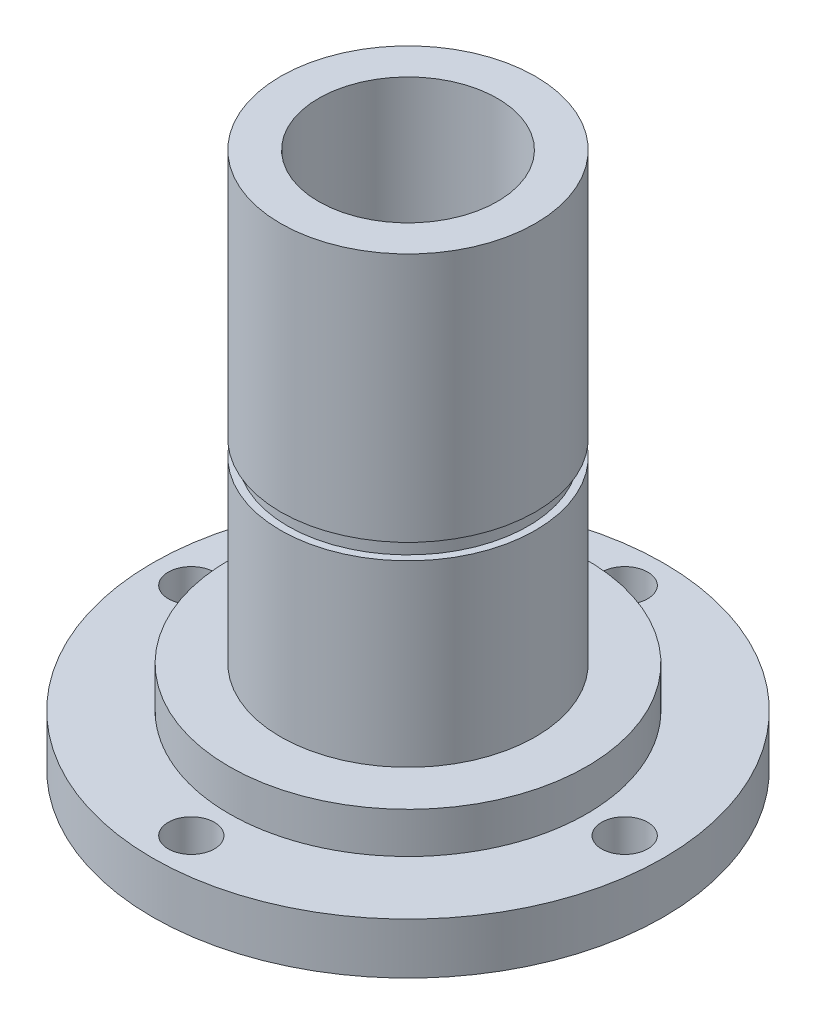
ISO-10303-21;
HEADER;
FILE_DESCRIPTION(('STEP AP214'),'2;1');
FILE_NAME('part.step','',(''),(''),'','','');
FILE_SCHEMA(('AUTOMOTIVE_DESIGN { 1 0 10303 214 1 1 1 1 }'));
ENDSEC;
DATA;
#1=APPLICATION_CONTEXT('core data for automotive mechanical design processes');
#2=APPLICATION_PROTOCOL_DEFINITION('international standard','automotive_design',2000,#1);
#3=PRODUCT_CONTEXT('',#1,'mechanical');
#4=PRODUCT('Part','Part','',(#3));
#5=PRODUCT_RELATED_PRODUCT_CATEGORY('part','',(#4));
#6=PRODUCT_DEFINITION_FORMATION('','',#4);
#7=PRODUCT_DEFINITION_CONTEXT('part definition',#1,'design');
#8=PRODUCT_DEFINITION('design','',#6,#7);
#9=PRODUCT_DEFINITION_SHAPE('','',#8);
#10=(LENGTH_UNIT() NAMED_UNIT(*) SI_UNIT(.MILLI.,.METRE.));
#11=(NAMED_UNIT(*) PLANE_ANGLE_UNIT() SI_UNIT($,.RADIAN.));
#12=(NAMED_UNIT(*) SI_UNIT($,.STERADIAN.) SOLID_ANGLE_UNIT());
#13=UNCERTAINTY_MEASURE_WITH_UNIT(LENGTH_MEASURE(1.E-05),#10,'distance_accuracy_value','');
#14=(GEOMETRIC_REPRESENTATION_CONTEXT(3) GLOBAL_UNCERTAINTY_ASSIGNED_CONTEXT((#13)) GLOBAL_UNIT_ASSIGNED_CONTEXT((#10,
#11,#12)) REPRESENTATION_CONTEXT('',''));
#15=CARTESIAN_POINT('',(0.,0.,0.));
#16=DIRECTION('',(0.,0.,1.));
#17=DIRECTION('',(1.,0.,0.));
#18=AXIS2_PLACEMENT_3D('',#15,#16,#17);
#19=CARTESIAN_POINT('',(0.,3.175,0.));
#20=DIRECTION('',(0.,-1.,0.));
#21=DIRECTION('',(0.,0.,-1.));
#22=AXIS2_PLACEMENT_3D('',#19,#20,#21);
#23=CYLINDRICAL_SURFACE('',#22,15.875);
#24=CARTESIAN_POINT('',(0.,3.175,0.));
#25=DIRECTION('',(0.,-1.,0.));
#26=DIRECTION('',(0.,0.,-1.));
#27=AXIS2_PLACEMENT_3D('',#24,#25,#26);
#28=CIRCLE('',#27,15.875);
#29=CARTESIAN_POINT('',(0.,3.175,-15.875));
#30=VERTEX_POINT('',#29);
#31=EDGE_CURVE('E12',#30,#30,#28,.T.);
#32=ORIENTED_EDGE('',*,*,#31,.T.);
#33=EDGE_LOOP('',(#32));
#34=FACE_BOUND('',#33,.T.);
#35=CARTESIAN_POINT('',(0.,0.,0.));
#36=DIRECTION('',(0.,-1.,0.));
#37=DIRECTION('',(0.,0.,-1.));
#38=AXIS2_PLACEMENT_3D('',#35,#36,#37);
#39=CIRCLE('',#38,15.875);
#40=CARTESIAN_POINT('',(0.,0.,-15.875));
#41=VERTEX_POINT('',#40);
#42=EDGE_CURVE('E46',#41,#41,#39,.T.);
#43=ORIENTED_EDGE('',*,*,#42,.F.);
#44=EDGE_LOOP('',(#43));
#45=FACE_BOUND('',#44,.T.);
#46=ADVANCED_FACE('F43',(#34,#45),#23,.T.);
#47=CARTESIAN_POINT('',(0.,3.175,0.));
#48=DIRECTION('',(0.,-1.,0.));
#49=DIRECTION('',(0.,0.,-1.));
#50=AXIS2_PLACEMENT_3D('',#47,#48,#49);
#51=PLANE('',#50);
#52=CARTESIAN_POINT('',(-13.462,3.175,0.));
#53=DIRECTION('',(0.,-1.,0.));
#54=DIRECTION('',(0.,0.,-1.));
#55=AXIS2_PLACEMENT_3D('',#52,#53,#54);
#56=CIRCLE('',#55,1.4351);
#57=CARTESIAN_POINT('',(-13.462,3.175,-1.4351));
#58=VERTEX_POINT('',#57);
#59=EDGE_CURVE('E76',#58,#58,#56,.T.);
#60=ORIENTED_EDGE('',*,*,#59,.T.);
#61=EDGE_LOOP('',(#60));
#62=FACE_BOUND('',#61,.T.);
#63=CARTESIAN_POINT('',(0.,3.175,-13.462));
#64=DIRECTION('',(0.,-1.,0.));
#65=DIRECTION('',(0.,0.,-1.));
#66=AXIS2_PLACEMENT_3D('',#63,#64,#65);
#67=CIRCLE('',#66,1.4351);
#68=CARTESIAN_POINT('',(0.,3.175,-14.8971));
#69=VERTEX_POINT('',#68);
#70=EDGE_CURVE('E70',#69,#69,#67,.T.);
#71=ORIENTED_EDGE('',*,*,#70,.T.);
#72=EDGE_LOOP('',(#71));
#73=FACE_BOUND('',#72,.T.);
#74=CARTESIAN_POINT('',(13.462,3.175,0.));
#75=DIRECTION('',(0.,-1.,0.));
#76=DIRECTION('',(0.,0.,-1.));
#77=AXIS2_PLACEMENT_3D('',#74,#75,#76);
#78=CIRCLE('',#77,1.4351);
#79=CARTESIAN_POINT('',(13.462,3.175,-1.4351));
#80=VERTEX_POINT('',#79);
#81=EDGE_CURVE('E64',#80,#80,#78,.T.);
#82=ORIENTED_EDGE('',*,*,#81,.T.);
#83=EDGE_LOOP('',(#82));
#84=FACE_BOUND('',#83,.T.);
#85=CARTESIAN_POINT('',(0.,3.175,0.));
#86=DIRECTION('',(0.,-1.,0.));
#87=DIRECTION('',(0.,0.,-1.));
#88=AXIS2_PLACEMENT_3D('',#85,#86,#87);
#89=CIRCLE('',#88,11.1125);
#90=CARTESIAN_POINT('',(0.,3.175,-11.1125));
#91=VERTEX_POINT('',#90);
#92=EDGE_CURVE('E58',#91,#91,#89,.T.);
#93=ORIENTED_EDGE('',*,*,#92,.T.);
#94=EDGE_LOOP('',(#93));
#95=FACE_BOUND('',#94,.T.);
#96=CARTESIAN_POINT('',(0.,3.175,13.462));
#97=DIRECTION('',(0.,-1.,0.));
#98=DIRECTION('',(0.,0.,-1.));
#99=AXIS2_PLACEMENT_3D('',#96,#97,#98);
#100=CIRCLE('',#99,1.4351);
#101=CARTESIAN_POINT('',(0.,3.175,12.0269));
#102=VERTEX_POINT('',#101);
#103=EDGE_CURVE('E53',#102,#102,#100,.T.);
#104=ORIENTED_EDGE('',*,*,#103,.T.);
#105=EDGE_LOOP('',(#104));
#106=FACE_BOUND('',#105,.T.);
#107=ORIENTED_EDGE('',*,*,#31,.F.);
#108=EDGE_LOOP('',(#107));
#109=FACE_BOUND('',#108,.T.);
#110=ADVANCED_FACE('F85',(#62,#73,#84,#95,#106,#109),#51,.F.);
#111=CARTESIAN_POINT('',(0.,0.,0.));
#112=DIRECTION('',(0.,-1.,0.));
#113=DIRECTION('',(0.,0.,-1.));
#114=AXIS2_PLACEMENT_3D('',#111,#112,#113);
#115=PLANE('',#114);
#116=CARTESIAN_POINT('',(-13.462,0.,0.));
#117=DIRECTION('',(0.,-1.,0.));
#118=DIRECTION('',(0.,0.,-1.));
#119=AXIS2_PLACEMENT_3D('',#116,#117,#118);
#120=CIRCLE('',#119,1.4351);
#121=CARTESIAN_POINT('',(-13.462,0.,-1.4351));
#122=VERTEX_POINT('',#121);
#123=EDGE_CURVE('E79',#122,#122,#120,.T.);
#124=ORIENTED_EDGE('',*,*,#123,.F.);
#125=EDGE_LOOP('',(#124));
#126=FACE_BOUND('',#125,.T.);
#127=CARTESIAN_POINT('',(0.,0.,-13.462));
#128=DIRECTION('',(0.,-1.,0.));
#129=DIRECTION('',(0.,0.,-1.));
#130=AXIS2_PLACEMENT_3D('',#127,#128,#129);
#131=CIRCLE('',#130,1.4351);
#132=CARTESIAN_POINT('',(0.,0.,-14.8971));
#133=VERTEX_POINT('',#132);
#134=EDGE_CURVE('E73',#133,#133,#131,.T.);
#135=ORIENTED_EDGE('',*,*,#134,.F.);
#136=EDGE_LOOP('',(#135));
#137=FACE_BOUND('',#136,.T.);
#138=CARTESIAN_POINT('',(13.462,0.,0.));
#139=DIRECTION('',(0.,-1.,0.));
#140=DIRECTION('',(0.,0.,-1.));
#141=AXIS2_PLACEMENT_3D('',#138,#139,#140);
#142=CIRCLE('',#141,1.4351);
#143=CARTESIAN_POINT('',(13.462,0.,-1.4351));
#144=VERTEX_POINT('',#143);
#145=EDGE_CURVE('E67',#144,#144,#142,.T.);
#146=ORIENTED_EDGE('',*,*,#145,.F.);
#147=EDGE_LOOP('',(#146));
#148=FACE_BOUND('',#147,.T.);
#149=CARTESIAN_POINT('',(0.,0.,0.));
#150=DIRECTION('',(0.,-1.,0.));
#151=DIRECTION('',(0.,0.,-1.));
#152=AXIS2_PLACEMENT_3D('',#149,#150,#151);
#153=CIRCLE('',#152,11.1125);
#154=CARTESIAN_POINT('',(0.,0.,-11.1125));
#155=VERTEX_POINT('',#154);
#156=EDGE_CURVE('E61',#155,#155,#153,.T.);
#157=ORIENTED_EDGE('',*,*,#156,.F.);
#158=EDGE_LOOP('',(#157));
#159=FACE_BOUND('',#158,.T.);
#160=CARTESIAN_POINT('',(0.,0.,13.462));
#161=DIRECTION('',(0.,-1.,0.));
#162=DIRECTION('',(0.,0.,-1.));
#163=AXIS2_PLACEMENT_3D('',#160,#161,#162);
#164=CIRCLE('',#163,1.4351);
#165=CARTESIAN_POINT('',(0.,0.,12.0269));
#166=VERTEX_POINT('',#165);
#167=EDGE_CURVE('E55',#166,#166,#164,.T.);
#168=ORIENTED_EDGE('',*,*,#167,.F.);
#169=EDGE_LOOP('',(#168));
#170=FACE_BOUND('',#169,.T.);
#171=ORIENTED_EDGE('',*,*,#42,.T.);
#172=EDGE_LOOP('',(#171));
#173=FACE_BOUND('',#172,.T.);
#174=ADVANCED_FACE('F95',(#126,#137,#148,#159,#170,#173),#115,.T.);
#175=CARTESIAN_POINT('',(0.,3.175,13.462));
#176=DIRECTION('',(0.,-1.,0.));
#177=DIRECTION('',(0.,0.,-1.));
#178=AXIS2_PLACEMENT_3D('',#175,#176,#177);
#179=CYLINDRICAL_SURFACE('',#178,1.4351);
#180=ORIENTED_EDGE('',*,*,#103,.F.);
#181=EDGE_LOOP('',(#180));
#182=FACE_BOUND('',#181,.T.);
#183=ORIENTED_EDGE('',*,*,#167,.T.);
#184=EDGE_LOOP('',(#183));
#185=FACE_BOUND('',#184,.T.);
#186=ADVANCED_FACE('F98',(#182,#185),#179,.F.);
#187=CARTESIAN_POINT('',(0.,3.175,0.));
#188=DIRECTION('',(0.,-1.,0.));
#189=DIRECTION('',(0.,0.,-1.));
#190=AXIS2_PLACEMENT_3D('',#187,#188,#189);
#191=CYLINDRICAL_SURFACE('',#190,11.1125);
#192=ORIENTED_EDGE('',*,*,#92,.F.);
#193=EDGE_LOOP('',(#192));
#194=FACE_BOUND('',#193,.T.);
#195=ORIENTED_EDGE('',*,*,#156,.T.);
#196=EDGE_LOOP('',(#195));
#197=FACE_BOUND('',#196,.T.);
#198=ADVANCED_FACE('F119',(#194,#197),#191,.F.);
#199=CARTESIAN_POINT('',(13.462,3.175,0.));
#200=DIRECTION('',(0.,-1.,0.));
#201=DIRECTION('',(0.,0.,-1.));
#202=AXIS2_PLACEMENT_3D('',#199,#200,#201);
#203=CYLINDRICAL_SURFACE('',#202,1.4351);
#204=ORIENTED_EDGE('',*,*,#81,.F.);
#205=EDGE_LOOP('',(#204));
#206=FACE_BOUND('',#205,.T.);
#207=ORIENTED_EDGE('',*,*,#145,.T.);
#208=EDGE_LOOP('',(#207));
#209=FACE_BOUND('',#208,.T.);
#210=ADVANCED_FACE('F123',(#206,#209),#203,.F.);
#211=CARTESIAN_POINT('',(0.,3.175,-13.462));
#212=DIRECTION('',(0.,-1.,0.));
#213=DIRECTION('',(0.,0.,-1.));
#214=AXIS2_PLACEMENT_3D('',#211,#212,#213);
#215=CYLINDRICAL_SURFACE('',#214,1.4351);
#216=ORIENTED_EDGE('',*,*,#70,.F.);
#217=EDGE_LOOP('',(#216));
#218=FACE_BOUND('',#217,.T.);
#219=ORIENTED_EDGE('',*,*,#134,.T.);
#220=EDGE_LOOP('',(#219));
#221=FACE_BOUND('',#220,.T.);
#222=ADVANCED_FACE('F91',(#218,#221),#215,.F.);
#223=CARTESIAN_POINT('',(-13.462,3.175,0.));
#224=DIRECTION('',(0.,-1.,0.));
#225=DIRECTION('',(0.,0.,-1.));
#226=AXIS2_PLACEMENT_3D('',#223,#224,#225);
#227=CYLINDRICAL_SURFACE('',#226,1.4351);
#228=ORIENTED_EDGE('',*,*,#59,.F.);
#229=EDGE_LOOP('',(#228));
#230=FACE_BOUND('',#229,.T.);
#231=ORIENTED_EDGE('',*,*,#123,.T.);
#232=EDGE_LOOP('',(#231));
#233=FACE_BOUND('',#232,.T.);
#234=ADVANCED_FACE('F88',(#230,#233),#227,.F.);
#235=CLOSED_SHELL('',(#46,#110,#174,#186,#198,#210,#222,#234));
#236=MANIFOLD_SOLID_BREP('B2',#235);
#237=CARTESIAN_POINT('',(0.,33.3375,0.));
#238=DIRECTION('',(0.,-1.,0.));
#239=DIRECTION('',(0.,0.,-1.));
#240=AXIS2_PLACEMENT_3D('',#237,#238,#239);
#241=CYLINDRICAL_SURFACE('',#240,7.91845);
#242=CARTESIAN_POINT('',(0.,5.715,0.));
#243=DIRECTION('',(0.,1.,0.));
#244=DIRECTION('',(0.,0.,1.));
#245=AXIS2_PLACEMENT_3D('',#242,#243,#244);
#246=CIRCLE('',#245,7.91845);
#247=CARTESIAN_POINT('',(0.,5.715,7.91845));
#248=VERTEX_POINT('',#247);
#249=EDGE_CURVE('E230',#248,#248,#246,.T.);
#250=ORIENTED_EDGE('',*,*,#249,.T.);
#251=EDGE_LOOP('',(#250));
#252=FACE_BOUND('',#251,.T.);
#253=CARTESIAN_POINT('',(0.,16.8275,0.));
#254=DIRECTION('',(0.,1.,0.));
#255=DIRECTION('',(0.,0.,1.));
#256=AXIS2_PLACEMENT_3D('',#253,#254,#255);
#257=CIRCLE('',#256,7.91845);
#258=CARTESIAN_POINT('',(0.,16.8275,7.91845));
#259=VERTEX_POINT('',#258);
#260=EDGE_CURVE('E213',#259,#259,#257,.T.);
#261=ORIENTED_EDGE('',*,*,#260,.F.);
#262=EDGE_LOOP('',(#261));
#263=FACE_BOUND('',#262,.T.);
#264=ADVANCED_FACE('F196',(#252,#263),#241,.T.);
#265=CARTESIAN_POINT('',(0.,5.715,0.));
#266=DIRECTION('',(0.,1.,0.));
#267=DIRECTION('',(0.,0.,1.));
#268=AXIS2_PLACEMENT_3D('',#265,#266,#267);
#269=PLANE('',#268);
#270=CARTESIAN_POINT('',(0.,5.715,0.));
#271=DIRECTION('',(0.,1.,0.));
#272=DIRECTION('',(0.,0.,1.));
#273=AXIS2_PLACEMENT_3D('',#270,#271,#272);
#274=CIRCLE('',#273,11.1125);
#275=CARTESIAN_POINT('',(0.,5.715,11.1125));
#276=VERTEX_POINT('',#275);
#277=EDGE_CURVE('E42',#276,#276,#274,.T.);
#278=ORIENTED_EDGE('',*,*,#277,.T.);
#279=EDGE_LOOP('',(#278));
#280=FACE_BOUND('',#279,.T.);
#281=ORIENTED_EDGE('',*,*,#249,.F.);
#282=EDGE_LOOP('',(#281));
#283=FACE_BOUND('',#282,.T.);
#284=ADVANCED_FACE('F238',(#280,#283),#269,.T.);
#285=CARTESIAN_POINT('',(0.,0.,0.));
#286=DIRECTION('',(0.,1.,0.));
#287=DIRECTION('',(0.,0.,1.));
#288=AXIS2_PLACEMENT_3D('',#285,#286,#287);
#289=PLANE('',#288);
#290=CARTESIAN_POINT('',(0.,0.,0.));
#291=DIRECTION('',(0.,1.,0.));
#292=DIRECTION('',(0.,0.,1.));
#293=AXIS2_PLACEMENT_3D('',#290,#291,#292);
#294=CIRCLE('',#293,11.1125);
#295=CARTESIAN_POINT('',(0.,0.,11.1125));
#296=VERTEX_POINT('',#295);
#297=EDGE_CURVE('E204',#296,#296,#294,.T.);
#298=ORIENTED_EDGE('',*,*,#297,.F.);
#299=EDGE_LOOP('',(#298));
#300=FACE_BOUND('',#299,.T.);
#301=CARTESIAN_POINT('',(0.,0.,0.));
#302=DIRECTION('',(0.,1.,0.));
#303=DIRECTION('',(0.,0.,1.));
#304=AXIS2_PLACEMENT_3D('',#301,#302,#303);
#305=CIRCLE('',#304,5.55625);
#306=CARTESIAN_POINT('',(0.,0.,5.55625));
#307=VERTEX_POINT('',#306);
#308=EDGE_CURVE('E209',#307,#307,#305,.T.);
#309=ORIENTED_EDGE('',*,*,#308,.T.);
#310=EDGE_LOOP('',(#309));
#311=FACE_BOUND('',#310,.T.);
#312=ADVANCED_FACE('F240',(#300,#311),#289,.F.);
#313=CARTESIAN_POINT('',(0.,5.715,0.));
#314=DIRECTION('',(0.,-1.,0.));
#315=DIRECTION('',(0.,0.,-1.));
#316=AXIS2_PLACEMENT_3D('',#313,#314,#315);
#317=CYLINDRICAL_SURFACE('',#316,11.1125);
#318=ORIENTED_EDGE('',*,*,#277,.F.);
#319=EDGE_LOOP('',(#318));
#320=FACE_BOUND('',#319,.T.);
#321=ORIENTED_EDGE('',*,*,#297,.T.);
#322=EDGE_LOOP('',(#321));
#323=FACE_BOUND('',#322,.T.);
#324=ADVANCED_FACE('F198',(#320,#323),#317,.T.);
#325=CARTESIAN_POINT('',(0.,5.715,0.));
#326=DIRECTION('',(0.,-1.,0.));
#327=DIRECTION('',(0.,0.,-1.));
#328=AXIS2_PLACEMENT_3D('',#325,#326,#327);
#329=CYLINDRICAL_SURFACE('',#328,5.55625);
#330=ORIENTED_EDGE('',*,*,#308,.F.);
#331=EDGE_LOOP('',(#330));
#332=FACE_BOUND('',#331,.T.);
#333=CARTESIAN_POINT('',(0.,33.3375,0.));
#334=DIRECTION('',(0.,1.,0.));
#335=DIRECTION('',(0.,0.,1.));
#336=AXIS2_PLACEMENT_3D('',#333,#334,#335);
#337=CIRCLE('',#336,5.55625);
#338=CARTESIAN_POINT('',(0.,33.3375,5.55625));
#339=VERTEX_POINT('',#338);
#340=EDGE_CURVE('E219',#339,#339,#337,.T.);
#341=ORIENTED_EDGE('',*,*,#340,.T.);
#342=EDGE_LOOP('',(#341));
#343=FACE_BOUND('',#342,.T.);
#344=ADVANCED_FACE('F250',(#332,#343),#329,.F.);
#345=CARTESIAN_POINT('',(0.,33.3375,0.));
#346=DIRECTION('',(0.,1.,0.));
#347=DIRECTION('',(0.,0.,1.));
#348=AXIS2_PLACEMENT_3D('',#345,#346,#347);
#349=PLANE('',#348);
#350=CARTESIAN_POINT('',(0.,33.3375,0.));
#351=DIRECTION('',(0.,1.,0.));
#352=DIRECTION('',(0.,0.,1.));
#353=AXIS2_PLACEMENT_3D('',#350,#351,#352);
#354=CIRCLE('',#353,7.91845);
#355=CARTESIAN_POINT('',(0.,33.3375,7.91845));
#356=VERTEX_POINT('',#355);
#357=EDGE_CURVE('E231',#356,#356,#354,.T.);
#358=ORIENTED_EDGE('',*,*,#357,.T.);
#359=EDGE_LOOP('',(#358));
#360=FACE_BOUND('',#359,.T.);
#361=ORIENTED_EDGE('',*,*,#340,.F.);
#362=EDGE_LOOP('',(#361));
#363=FACE_BOUND('',#362,.T.);
#364=ADVANCED_FACE('F252',(#360,#363),#349,.T.);
#365=CARTESIAN_POINT('',(0.,17.8181,0.));
#366=DIRECTION('',(0.,1.,0.));
#367=DIRECTION('',(0.,0.,1.));
#368=AXIS2_PLACEMENT_3D('',#365,#366,#367);
#369=CIRCLE('',#368,7.91845);
#370=CARTESIAN_POINT('',(0.,17.8181,7.91845));
#371=VERTEX_POINT('',#370);
#372=EDGE_CURVE('E200',#371,#371,#369,.T.);
#373=ORIENTED_EDGE('',*,*,#372,.T.);
#374=EDGE_LOOP('',(#373));
#375=FACE_BOUND('',#374,.T.);
#376=ORIENTED_EDGE('',*,*,#357,.F.);
#377=EDGE_LOOP('',(#376));
#378=FACE_BOUND('',#377,.T.);
#379=ADVANCED_FACE('F248',(#375,#378),#241,.T.);
#380=CARTESIAN_POINT('',(0.,17.8181,0.));
#381=DIRECTION('',(0.,1.,0.));
#382=DIRECTION('',(0.,0.,1.));
#383=AXIS2_PLACEMENT_3D('',#380,#381,#382);
#384=PLANE('',#383);
#385=CARTESIAN_POINT('',(0.,17.8181,0.));
#386=DIRECTION('',(0.,1.,0.));
#387=DIRECTION('',(0.,0.,1.));
#388=AXIS2_PLACEMENT_3D('',#385,#386,#387);
#389=CIRCLE('',#388,7.4676);
#390=CARTESIAN_POINT('',(0.,17.8181,7.4676));
#391=VERTEX_POINT('',#390);
#392=EDGE_CURVE('E215',#391,#391,#389,.T.);
#393=ORIENTED_EDGE('',*,*,#392,.T.);
#394=EDGE_LOOP('',(#393));
#395=FACE_BOUND('',#394,.T.);
#396=ORIENTED_EDGE('',*,*,#372,.F.);
#397=EDGE_LOOP('',(#396));
#398=FACE_BOUND('',#397,.T.);
#399=ADVANCED_FACE('F256',(#395,#398),#384,.F.);
#400=CARTESIAN_POINT('',(0.,16.8275,0.));
#401=DIRECTION('',(0.,1.,0.));
#402=DIRECTION('',(0.,0.,1.));
#403=AXIS2_PLACEMENT_3D('',#400,#401,#402);
#404=PLANE('',#403);
#405=CARTESIAN_POINT('',(0.,16.8275,0.));
#406=DIRECTION('',(0.,1.,0.));
#407=DIRECTION('',(0.,0.,1.));
#408=AXIS2_PLACEMENT_3D('',#405,#406,#407);
#409=CIRCLE('',#408,7.4676);
#410=CARTESIAN_POINT('',(0.,16.8275,7.4676));
#411=VERTEX_POINT('',#410);
#412=EDGE_CURVE('E221',#411,#411,#409,.T.);
#413=ORIENTED_EDGE('',*,*,#412,.F.);
#414=EDGE_LOOP('',(#413));
#415=FACE_BOUND('',#414,.T.);
#416=ORIENTED_EDGE('',*,*,#260,.T.);
#417=EDGE_LOOP('',(#416));
#418=FACE_BOUND('',#417,.T.);
#419=ADVANCED_FACE('F261',(#415,#418),#404,.T.);
#420=CARTESIAN_POINT('',(0.,17.8181,0.));
#421=DIRECTION('',(0.,-1.,0.));
#422=DIRECTION('',(0.,0.,-1.));
#423=AXIS2_PLACEMENT_3D('',#420,#421,#422);
#424=CYLINDRICAL_SURFACE('',#423,7.4676);
#425=ORIENTED_EDGE('',*,*,#392,.F.);
#426=EDGE_LOOP('',(#425));
#427=FACE_BOUND('',#426,.T.);
#428=ORIENTED_EDGE('',*,*,#412,.T.);
#429=EDGE_LOOP('',(#428));
#430=FACE_BOUND('',#429,.T.);
#431=ADVANCED_FACE('F264',(#427,#430),#424,.T.);
#432=CLOSED_SHELL('',(#264,#284,#312,#324,#344,#364,#379,#399,#419,#431));
#433=MANIFOLD_SOLID_BREP('B7',#432);
#434=ADVANCED_BREP_SHAPE_REPRESENTATION('',(#18,#236,#433),#14);
#435=SHAPE_DEFINITION_REPRESENTATION(#9,#434);
ENDSEC;
END-ISO-10303-21;
